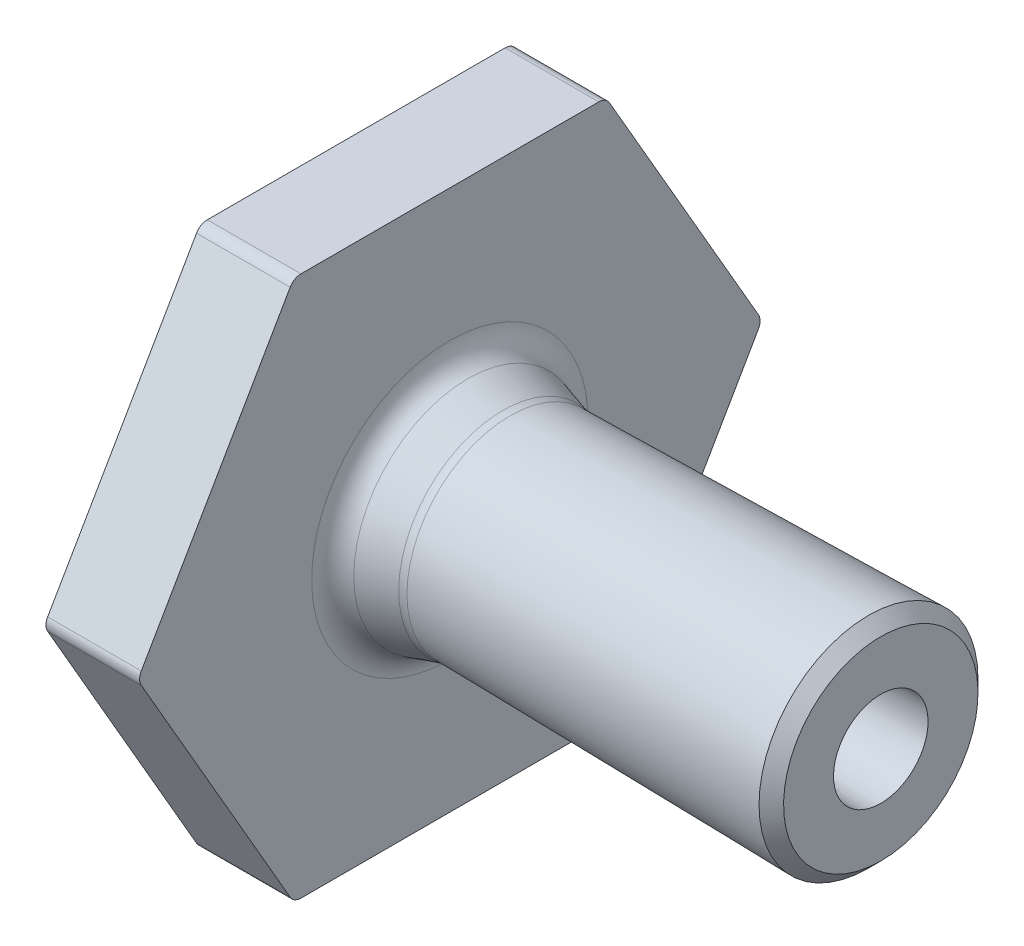
ISO-10303-21;
HEADER;
FILE_DESCRIPTION(('STEP AP214'),'2;1');
FILE_NAME('part.step','',(''),(''),'','','');
FILE_SCHEMA(('AUTOMOTIVE_DESIGN { 1 0 10303 214 1 1 1 1 }'));
ENDSEC;
DATA;
#1=APPLICATION_CONTEXT('core data for automotive mechanical design processes');
#2=APPLICATION_PROTOCOL_DEFINITION('international standard','automotive_design',2000,#1);
#3=PRODUCT_CONTEXT('',#1,'mechanical');
#4=PRODUCT('Part','Part','',(#3));
#5=PRODUCT_RELATED_PRODUCT_CATEGORY('part','',(#4));
#6=PRODUCT_DEFINITION_FORMATION('','',#4);
#7=PRODUCT_DEFINITION_CONTEXT('part definition',#1,'design');
#8=PRODUCT_DEFINITION('design','',#6,#7);
#9=PRODUCT_DEFINITION_SHAPE('','',#8);
#10=(LENGTH_UNIT() NAMED_UNIT(*) SI_UNIT(.MILLI.,.METRE.));
#11=(NAMED_UNIT(*) PLANE_ANGLE_UNIT() SI_UNIT($,.RADIAN.));
#12=(NAMED_UNIT(*) SI_UNIT($,.STERADIAN.) SOLID_ANGLE_UNIT());
#13=UNCERTAINTY_MEASURE_WITH_UNIT(LENGTH_MEASURE(1.E-05),#10,'distance_accuracy_value','');
#14=(GEOMETRIC_REPRESENTATION_CONTEXT(3) GLOBAL_UNCERTAINTY_ASSIGNED_CONTEXT((#13)) GLOBAL_UNIT_ASSIGNED_CONTEXT((#10,
#11,#12)) REPRESENTATION_CONTEXT('',''));
#15=CARTESIAN_POINT('',(0.,0.,0.));
#16=DIRECTION('',(0.,0.,1.));
#17=DIRECTION('',(1.,0.,0.));
#18=AXIS2_PLACEMENT_3D('',#15,#16,#17);
#19=CARTESIAN_POINT('',(6.99999999999996,3.82500000000001,0.));
#20=DIRECTION('',(-1.,0.,0.));
#21=DIRECTION('',(0.,-1.,0.));
#22=AXIS2_PLACEMENT_3D('',#19,#20,#21);
#23=PLANE('',#22);
#24=CARTESIAN_POINT('',(6.99999999999996,0.,0.));
#25=DIRECTION('',(-1.,0.,0.));
#26=DIRECTION('',(0.,-1.,0.));
#27=AXIS2_PLACEMENT_3D('',#24,#25,#26);
#28=CIRCLE('',#27,4.42784324008224);
#29=CARTESIAN_POINT('',(6.99999999999996,-4.42784324008224,0.));
#30=VERTEX_POINT('',#29);
#31=EDGE_CURVE('E285',#30,#30,#28,.T.);
#32=ORIENTED_EDGE('',*,*,#31,.T.);
#33=EDGE_LOOP('',(#32));
#34=FACE_BOUND('',#33,.T.);
#35=DIRECTION('',(0.,-0.866025403784439,-0.5));
#36=VECTOR('',#35,1.);
#37=CARTESIAN_POINT('',(6.99999999999996,7.1988770189222,-5.84372641526227));
#38=LINE('',#37,#36);
#39=CARTESIAN_POINT('',(6.99999999999996,8.4602540378444,-5.11547005383793));
#40=VERTEX_POINT('',#39);
#41=CARTESIAN_POINT('',(6.99999999999996,0.200000000000001,-9.88452994616208));
#42=VERTEX_POINT('',#41);
#43=EDGE_CURVE('E193',#40,#42,#38,.T.);
#44=ORIENTED_EDGE('',*,*,#43,.F.);
#45=CARTESIAN_POINT('',(6.99999999999996,8.2602540378444,-4.76905989232416));
#46=DIRECTION('',(-1.,0.,0.));
#47=DIRECTION('',(0.,-1.,0.));
#48=AXIS2_PLACEMENT_3D('',#45,#46,#47);
#49=CIRCLE('',#48,0.4);
#50=CARTESIAN_POINT('',(6.99999999999996,8.66025403784439,-4.76905989232416));
#51=VERTEX_POINT('',#50);
#52=EDGE_CURVE('E176',#40,#51,#49,.F.);
#53=ORIENTED_EDGE('',*,*,#52,.T.);
#54=DIRECTION('',(0.,0.,-1.));
#55=VECTOR('',#54,1.);
#56=CARTESIAN_POINT('',(6.99999999999996,8.66025403784439,0.));
#57=LINE('',#56,#55);
#58=CARTESIAN_POINT('',(6.99999999999996,8.66025403784439,4.76905989232416));
#59=VERTEX_POINT('',#58);
#60=EDGE_CURVE('E207',#59,#51,#57,.T.);
#61=ORIENTED_EDGE('',*,*,#60,.F.);
#62=CARTESIAN_POINT('',(6.99999999999996,8.2602540378444,4.76905989232416));
#63=DIRECTION('',(-1.,0.,0.));
#64=DIRECTION('',(0.,-1.,0.));
#65=AXIS2_PLACEMENT_3D('',#62,#63,#64);
#66=CIRCLE('',#65,0.4);
#67=CARTESIAN_POINT('',(6.99999999999996,8.4602540378444,5.11547005383793));
#68=VERTEX_POINT('',#67);
#69=EDGE_CURVE('E197',#59,#68,#66,.F.);
#70=ORIENTED_EDGE('',*,*,#69,.T.);
#71=DIRECTION('',(0.,0.866025403784439,-0.5));
#72=VECTOR('',#71,1.);
#73=CARTESIAN_POINT('',(6.99999999999996,7.1988770189222,5.84372641526227));
#74=LINE('',#73,#72);
#75=CARTESIAN_POINT('',(6.99999999999996,0.2,9.88452994616209));
#76=VERTEX_POINT('',#75);
#77=EDGE_CURVE('E201',#76,#68,#74,.T.);
#78=ORIENTED_EDGE('',*,*,#77,.F.);
#79=CARTESIAN_POINT('',(6.99999999999996,0.,9.53811978464831));
#80=DIRECTION('',(-1.,0.,0.));
#81=DIRECTION('',(0.,-1.,0.));
#82=AXIS2_PLACEMENT_3D('',#79,#80,#81);
#83=CIRCLE('',#82,0.4);
#84=CARTESIAN_POINT('',(6.99999999999996,-0.199999999999997,9.88452994616209));
#85=VERTEX_POINT('',#84);
#86=EDGE_CURVE('E245',#76,#85,#83,.F.);
#87=ORIENTED_EDGE('',*,*,#86,.T.);
#88=DIRECTION('',(0.,0.866025403784439,0.5));
#89=VECTOR('',#88,1.);
#90=CARTESIAN_POINT('',(6.99999999999996,-1.46137701892219,9.15627358473775));
#91=LINE('',#90,#89);
#92=CARTESIAN_POINT('',(6.99999999999996,-8.4602540378444,5.11547005383793));
#93=VERTEX_POINT('',#92);
#94=EDGE_CURVE('E586',#93,#85,#91,.T.);
#95=ORIENTED_EDGE('',*,*,#94,.F.);
#96=CARTESIAN_POINT('',(6.99999999999996,-8.2602540378444,4.76905989232415));
#97=DIRECTION('',(-1.,0.,0.));
#98=DIRECTION('',(0.,-1.,0.));
#99=AXIS2_PLACEMENT_3D('',#96,#97,#98);
#100=CIRCLE('',#99,0.4);
#101=CARTESIAN_POINT('',(6.99999999999996,-8.6602540378444,4.76905989232415));
#102=VERTEX_POINT('',#101);
#103=EDGE_CURVE('E247',#93,#102,#100,.F.);
#104=ORIENTED_EDGE('',*,*,#103,.T.);
#105=DIRECTION('',(0.,0.,1.));
#106=VECTOR('',#105,1.);
#107=CARTESIAN_POINT('',(6.99999999999996,-8.6602540378444,0.));
#108=LINE('',#107,#106);
#109=CARTESIAN_POINT('',(6.99999999999996,-8.6602540378444,-4.76905989232415));
#110=VERTEX_POINT('',#109);
#111=EDGE_CURVE('E202',#110,#102,#108,.T.);
#112=ORIENTED_EDGE('',*,*,#111,.F.);
#113=CARTESIAN_POINT('',(6.99999999999996,-8.2602540378444,-4.76905989232415));
#114=DIRECTION('',(-1.,0.,0.));
#115=DIRECTION('',(0.,-1.,0.));
#116=AXIS2_PLACEMENT_3D('',#113,#114,#115);
#117=CIRCLE('',#116,0.4);
#118=CARTESIAN_POINT('',(6.99999999999996,-8.4602540378444,-5.11547005383793));
#119=VERTEX_POINT('',#118);
#120=EDGE_CURVE('E249',#110,#119,#117,.F.);
#121=ORIENTED_EDGE('',*,*,#120,.T.);
#122=DIRECTION('',(0.,-0.866025403784439,0.5));
#123=VECTOR('',#122,1.);
#124=CARTESIAN_POINT('',(6.99999999999996,-1.46137701892219,-9.15627358473775));
#125=LINE('',#124,#123);
#126=CARTESIAN_POINT('',(6.99999999999996,-0.199999999999998,-9.88452994616208));
#127=VERTEX_POINT('',#126);
#128=EDGE_CURVE('E578',#127,#119,#125,.T.);
#129=ORIENTED_EDGE('',*,*,#128,.F.);
#130=CARTESIAN_POINT('',(6.99999999999996,0.,-9.53811978464831));
#131=DIRECTION('',(-1.,0.,0.));
#132=DIRECTION('',(0.,-1.,0.));
#133=AXIS2_PLACEMENT_3D('',#130,#131,#132);
#134=CIRCLE('',#133,0.4);
#135=EDGE_CURVE('E187',#127,#42,#134,.F.);
#136=ORIENTED_EDGE('',*,*,#135,.T.);
#137=EDGE_LOOP('',(#44,#53,#61,#70,#78,#87,#95,#104,#112,#121,#129,#136));
#138=FACE_BOUND('',#137,.T.);
#139=ADVANCED_FACE('F85',(#34,#138),#23,.F.);
#140=CARTESIAN_POINT('',(4.,10.,0.));
#141=DIRECTION('',(1.,0.,0.));
#142=DIRECTION('',(0.,1.,0.));
#143=AXIS2_PLACEMENT_3D('',#140,#141,#142);
#144=PLANE('',#143);
#145=CARTESIAN_POINT('',(4.,0.,0.));
#146=DIRECTION('',(1.,0.,0.));
#147=DIRECTION('',(0.,1.,0.));
#148=AXIS2_PLACEMENT_3D('',#145,#146,#147);
#149=CIRCLE('',#148,2.82500000000001);
#150=CARTESIAN_POINT('',(4.,2.82500000000001,0.));
#151=VERTEX_POINT('',#150);
#152=EDGE_CURVE('E12',#151,#151,#149,.T.);
#153=ORIENTED_EDGE('',*,*,#152,.T.);
#154=EDGE_LOOP('',(#153));
#155=FACE_BOUND('',#154,.T.);
#156=DIRECTION('',(0.,0.,1.));
#157=VECTOR('',#156,1.);
#158=CARTESIAN_POINT('',(4.,8.66025403784439,0.));
#159=LINE('',#158,#157);
#160=CARTESIAN_POINT('',(4.,8.66025403784439,-4.76905989232416));
#161=VERTEX_POINT('',#160);
#162=CARTESIAN_POINT('',(4.,8.66025403784439,4.76905989232416));
#163=VERTEX_POINT('',#162);
#164=EDGE_CURVE('E583',#161,#163,#159,.T.);
#165=ORIENTED_EDGE('',*,*,#164,.F.);
#166=CARTESIAN_POINT('',(4.,8.2602540378444,-4.76905989232416));
#167=DIRECTION('',(1.,0.,0.));
#168=DIRECTION('',(0.,1.,0.));
#169=AXIS2_PLACEMENT_3D('',#166,#167,#168);
#170=CIRCLE('',#169,0.4);
#171=CARTESIAN_POINT('',(4.,8.4602540378444,-5.11547005383793));
#172=VERTEX_POINT('',#171);
#173=EDGE_CURVE('E264',#161,#172,#170,.F.);
#174=ORIENTED_EDGE('',*,*,#173,.T.);
#175=DIRECTION('',(0.,0.866025403784439,0.5));
#176=VECTOR('',#175,1.);
#177=CARTESIAN_POINT('',(4.,11.8301270189222,-3.16987298107782));
#178=LINE('',#177,#176);
#179=CARTESIAN_POINT('',(4.,0.199999999999999,-9.88452994616208));
#180=VERTEX_POINT('',#179);
#181=EDGE_CURVE('E196',#180,#172,#178,.T.);
#182=ORIENTED_EDGE('',*,*,#181,.F.);
#183=CARTESIAN_POINT('',(4.,0.,-9.53811978464831));
#184=DIRECTION('',(1.,0.,0.));
#185=DIRECTION('',(0.,1.,0.));
#186=AXIS2_PLACEMENT_3D('',#183,#184,#185);
#187=CIRCLE('',#186,0.4);
#188=CARTESIAN_POINT('',(4.,-0.199999999999998,-9.88452994616208));
#189=VERTEX_POINT('',#188);
#190=EDGE_CURVE('E262',#180,#189,#187,.F.);
#191=ORIENTED_EDGE('',*,*,#190,.T.);
#192=DIRECTION('',(0.,0.866025403784439,-0.5));
#193=VECTOR('',#192,1.);
#194=CARTESIAN_POINT('',(4.,3.16987298107781,-11.8301270189222));
#195=LINE('',#194,#193);
#196=CARTESIAN_POINT('',(4.,-8.4602540378444,-5.11547005383792));
#197=VERTEX_POINT('',#196);
#198=EDGE_CURVE('E573',#197,#189,#195,.T.);
#199=ORIENTED_EDGE('',*,*,#198,.F.);
#200=CARTESIAN_POINT('',(4.,-8.2602540378444,-4.76905989232415));
#201=DIRECTION('',(1.,0.,0.));
#202=DIRECTION('',(0.,1.,0.));
#203=AXIS2_PLACEMENT_3D('',#200,#201,#202);
#204=CIRCLE('',#203,0.4);
#205=CARTESIAN_POINT('',(4.,-8.6602540378444,-4.76905989232415));
#206=VERTEX_POINT('',#205);
#207=EDGE_CURVE('E260',#197,#206,#204,.F.);
#208=ORIENTED_EDGE('',*,*,#207,.T.);
#209=DIRECTION('',(0.,0.,-1.));
#210=VECTOR('',#209,1.);
#211=CARTESIAN_POINT('',(4.,-8.6602540378444,0.));
#212=LINE('',#211,#210);
#213=CARTESIAN_POINT('',(4.,-8.6602540378444,4.76905989232415));
#214=VERTEX_POINT('',#213);
#215=EDGE_CURVE('E237',#214,#206,#212,.T.);
#216=ORIENTED_EDGE('',*,*,#215,.F.);
#217=CARTESIAN_POINT('',(4.,-8.2602540378444,4.76905989232415));
#218=DIRECTION('',(1.,0.,0.));
#219=DIRECTION('',(0.,1.,0.));
#220=AXIS2_PLACEMENT_3D('',#217,#218,#219);
#221=CIRCLE('',#220,0.4);
#222=CARTESIAN_POINT('',(4.,-8.4602540378444,5.11547005383793));
#223=VERTEX_POINT('',#222);
#224=EDGE_CURVE('E258',#214,#223,#221,.F.);
#225=ORIENTED_EDGE('',*,*,#224,.T.);
#226=DIRECTION('',(0.,-0.866025403784439,-0.5));
#227=VECTOR('',#226,1.);
#228=CARTESIAN_POINT('',(4.,3.16987298107781,11.8301270189222));
#229=LINE('',#228,#227);
#230=CARTESIAN_POINT('',(4.,-0.199999999999999,9.88452994616208));
#231=VERTEX_POINT('',#230);
#232=EDGE_CURVE('E589',#231,#223,#229,.T.);
#233=ORIENTED_EDGE('',*,*,#232,.F.);
#234=CARTESIAN_POINT('',(4.,0.,9.53811978464831));
#235=DIRECTION('',(1.,0.,0.));
#236=DIRECTION('',(0.,1.,0.));
#237=AXIS2_PLACEMENT_3D('',#234,#235,#236);
#238=CIRCLE('',#237,0.4);
#239=CARTESIAN_POINT('',(4.,0.199999999999997,9.88452994616209));
#240=VERTEX_POINT('',#239);
#241=EDGE_CURVE('E100',#231,#240,#238,.F.);
#242=ORIENTED_EDGE('',*,*,#241,.T.);
#243=DIRECTION('',(0.,-0.866025403784439,0.5));
#244=VECTOR('',#243,1.);
#245=CARTESIAN_POINT('',(4.,11.8301270189222,3.16987298107781));
#246=LINE('',#245,#244);
#247=CARTESIAN_POINT('',(4.,8.46025403784439,5.11547005383793));
#248=VERTEX_POINT('',#247);
#249=EDGE_CURVE('E241',#248,#240,#246,.T.);
#250=ORIENTED_EDGE('',*,*,#249,.F.);
#251=CARTESIAN_POINT('',(4.,8.2602540378444,4.76905989232416));
#252=DIRECTION('',(1.,0.,0.));
#253=DIRECTION('',(0.,1.,0.));
#254=AXIS2_PLACEMENT_3D('',#251,#252,#253);
#255=CIRCLE('',#254,0.4);
#256=EDGE_CURVE('E255',#248,#163,#255,.F.);
#257=ORIENTED_EDGE('',*,*,#256,.T.);
#258=EDGE_LOOP('',(#165,#174,#182,#191,#199,#208,#216,#225,#233,#242,#250,#257));
#259=FACE_BOUND('',#258,.T.);
#260=ADVANCED_FACE('F312',(#155,#259),#144,.F.);
#261=CARTESIAN_POINT('',(6.71891833059518,0.,0.));
#262=DIRECTION('',(-1.,0.,0.));
#263=DIRECTION('',(0.,-1.,0.));
#264=AXIS2_PLACEMENT_3D('',#261,#262,#263);
#265=CONICAL_SURFACE('',#264,1.82500000000001,0.279252680319093);
#266=CARTESIAN_POINT('',(8.11882634456201,0.,0.));
#267=DIRECTION('',(1.,0.,0.));
#268=DIRECTION('',(0.,1.,0.));
#269=AXIS2_PLACEMENT_3D('',#266,#267,#268);
#270=CIRCLE('',#269,1.42358283650824);
#271=CARTESIAN_POINT('',(8.11882634456201,1.42358283650824,0.));
#272=VERTEX_POINT('',#271);
#273=EDGE_CURVE('E225',#272,#272,#270,.T.);
#274=ORIENTED_EDGE('',*,*,#273,.T.);
#275=EDGE_LOOP('',(#274));
#276=FACE_BOUND('',#275,.T.);
#277=CARTESIAN_POINT('',(7.124207893939,0.,0.));
#278=DIRECTION('',(-1.,0.,0.));
#279=DIRECTION('',(0.,-1.,0.));
#280=AXIS2_PLACEMENT_3D('',#277,#278,#279);
#281=CIRCLE('',#280,1.70878508781496);
#282=CARTESIAN_POINT('',(7.124207893939,-1.70878508781496,0.));
#283=VERTEX_POINT('',#282);
#284=EDGE_CURVE('E222',#283,#283,#281,.T.);
#285=ORIENTED_EDGE('',*,*,#284,.T.);
#286=EDGE_LOOP('',(#285));
#287=FACE_BOUND('',#286,.T.);
#288=ADVANCED_FACE('F318',(#276,#287),#265,.F.);
#289=CARTESIAN_POINT('',(8.54981091361165,0.,0.));
#290=DIRECTION('',(1.,0.,0.));
#291=DIRECTION('',(0.,1.,0.));
#292=AXIS2_PLACEMENT_3D('',#289,#290,#291);
#293=CONICAL_SURFACE('',#292,1.30000000000001,0.0174532925199508);
#294=CARTESIAN_POINT('',(8.99809563132489,0.,0.));
#295=DIRECTION('',(-1.,0.,0.));
#296=DIRECTION('',(0.,-1.,0.));
#297=AXIS2_PLACEMENT_3D('',#294,#295,#296);
#298=CIRCLE('',#297,1.30782483885402);
#299=CARTESIAN_POINT('',(8.99809563132489,-1.30782483885402,0.));
#300=VERTEX_POINT('',#299);
#301=EDGE_CURVE('E219',#300,#300,#298,.T.);
#302=ORIENTED_EDGE('',*,*,#301,.T.);
#303=EDGE_LOOP('',(#302));
#304=FACE_BOUND('',#303,.T.);
#305=CARTESIAN_POINT('',(20.8041337064255,0.,0.));
#306=DIRECTION('',(-1.,0.,0.));
#307=DIRECTION('',(0.,-1.,0.));
#308=AXIS2_PLACEMENT_3D('',#305,#306,#307);
#309=CIRCLE('',#308,1.5139);
#310=CARTESIAN_POINT('',(20.8041337064255,-1.5139,0.));
#311=VERTEX_POINT('',#310);
#312=EDGE_CURVE('E216',#311,#311,#309,.T.);
#313=ORIENTED_EDGE('',*,*,#312,.F.);
#314=EDGE_LOOP('',(#313));
#315=FACE_BOUND('',#314,.T.);
#316=ADVANCED_FACE('F334',(#304,#315),#293,.F.);
#317=CARTESIAN_POINT('',(20.8041337064256,1.5139,0.));
#318=DIRECTION('',(-1.,0.,0.));
#319=DIRECTION('',(0.,-1.,0.));
#320=AXIS2_PLACEMENT_3D('',#317,#318,#319);
#321=PLANE('',#320);
#322=CARTESIAN_POINT('',(20.8041337064256,0.,0.));
#323=DIRECTION('',(-1.,0.,0.));
#324=DIRECTION('',(0.,-1.,0.));
#325=AXIS2_PLACEMENT_3D('',#322,#323,#324);
#326=CIRCLE('',#325,3.11420465608784);
#327=CARTESIAN_POINT('',(20.8041337064256,-3.11420465608784,0.));
#328=VERTEX_POINT('',#327);
#329=EDGE_CURVE('E234',#328,#328,#326,.F.);
#330=ORIENTED_EDGE('',*,*,#329,.T.);
#331=EDGE_LOOP('',(#330));
#332=FACE_BOUND('',#331,.T.);
#333=ORIENTED_EDGE('',*,*,#312,.T.);
#334=EDGE_LOOP('',(#333));
#335=FACE_BOUND('',#334,.T.);
#336=ADVANCED_FACE('F330',(#332,#335),#321,.F.);
#337=CARTESIAN_POINT('',(8.81376257921256,0.,0.));
#338=DIRECTION('',(1.,0.,0.));
#339=DIRECTION('',(0.,1.,0.));
#340=AXIS2_PLACEMENT_3D('',#337,#338,#339);
#341=CONICAL_SURFACE('',#340,3.3049119495488,0.0174532925199508);
#342=CARTESIAN_POINT('',(8.93330517060276,0.,0.));
#343=DIRECTION('',(1.,0.,0.));
#344=DIRECTION('',(0.,1.,0.));
#345=AXIS2_PLACEMENT_3D('',#342,#343,#344);
#346=CIRCLE('',#345,3.3069985732432);
#347=CARTESIAN_POINT('',(8.93330517060276,3.3069985732432,0.));
#348=VERTEX_POINT('',#347);
#349=EDGE_CURVE('E294',#348,#348,#346,.T.);
#350=ORIENTED_EDGE('',*,*,#349,.T.);
#351=EDGE_LOOP('',(#350));
#352=FACE_BOUND('',#351,.T.);
#353=CARTESIAN_POINT('',(20.4109959514642,0.,0.));
#354=DIRECTION('',(1.,0.,0.));
#355=DIRECTION('',(0.,1.,0.));
#356=AXIS2_PLACEMENT_3D('',#353,#354,#355);
#357=CIRCLE('',#356,3.50734241104923);
#358=CARTESIAN_POINT('',(20.4109959514642,3.50734241104923,0.));
#359=VERTEX_POINT('',#358);
#360=EDGE_CURVE('E231',#359,#359,#357,.F.);
#361=ORIENTED_EDGE('',*,*,#360,.T.);
#362=EDGE_LOOP('',(#361));
#363=FACE_BOUND('',#362,.T.);
#364=ADVANCED_FACE('F326',(#352,#363),#341,.T.);
#365=CARTESIAN_POINT('',(6.99999999999997,0.,0.));
#366=DIRECTION('',(-1.,0.,0.));
#367=DIRECTION('',(0.,-1.,0.));
#368=AXIS2_PLACEMENT_3D('',#365,#366,#367);
#369=CONICAL_SURFACE('',#368,3.82500000000001,0.279252680319094);
#370=CARTESIAN_POINT('',(7.57949011534636,0.,0.));
#371=DIRECTION('',(1.,0.,0.));
#372=DIRECTION('',(0.,1.,0.));
#373=AXIS2_PLACEMENT_3D('',#370,#371,#372);
#374=CIRCLE('',#373,3.65883388333159);
#375=CARTESIAN_POINT('',(7.57949011534636,3.65883388333159,0.));
#376=VERTEX_POINT('',#375);
#377=EDGE_CURVE('E291',#376,#376,#374,.T.);
#378=ORIENTED_EDGE('',*,*,#377,.T.);
#379=EDGE_LOOP('',(#378));
#380=FACE_BOUND('',#379,.T.);
#381=CARTESIAN_POINT('',(8.69883336079932,0.,0.));
#382=DIRECTION('',(-1.,0.,0.));
#383=DIRECTION('',(0.,-1.,0.));
#384=AXIS2_PLACEMENT_3D('',#381,#382,#383);
#385=CIRCLE('',#384,3.33786737261766);
#386=CARTESIAN_POINT('',(8.69883336079932,-3.33786737261766,0.));
#387=VERTEX_POINT('',#386);
#388=EDGE_CURVE('E288',#387,#387,#385,.T.);
#389=ORIENTED_EDGE('',*,*,#388,.T.);
#390=EDGE_LOOP('',(#389));
#391=FACE_BOUND('',#390,.T.);
#392=ADVANCED_FACE('F323',(#380,#391),#369,.T.);
#393=CARTESIAN_POINT('',(0.,0.,0.));
#394=DIRECTION('',(-1.,0.,0.));
#395=DIRECTION('',(0.,-1.,0.));
#396=AXIS2_PLACEMENT_3D('',#393,#394,#395);
#397=CYLINDRICAL_SURFACE('',#396,2.62500000000001);
#398=CARTESIAN_POINT('',(3.8,0.,0.));
#399=DIRECTION('',(1.,0.,0.));
#400=DIRECTION('',(0.,1.,0.));
#401=AXIS2_PLACEMENT_3D('',#398,#399,#400);
#402=CIRCLE('',#401,2.62500000000001);
#403=CARTESIAN_POINT('',(3.8,2.62500000000001,0.));
#404=VERTEX_POINT('',#403);
#405=EDGE_CURVE('E93',#404,#404,#402,.F.);
#406=ORIENTED_EDGE('',*,*,#405,.T.);
#407=EDGE_LOOP('',(#406));
#408=FACE_BOUND('',#407,.T.);
#409=CARTESIAN_POINT('',(0.,0.,0.));
#410=DIRECTION('',(-1.,0.,0.));
#411=DIRECTION('',(0.,-1.,0.));
#412=AXIS2_PLACEMENT_3D('',#409,#410,#411);
#413=CIRCLE('',#412,2.62500000000001);
#414=CARTESIAN_POINT('',(0.,-2.62500000000001,0.));
#415=VERTEX_POINT('',#414);
#416=EDGE_CURVE('E213',#415,#415,#413,.T.);
#417=ORIENTED_EDGE('',*,*,#416,.F.);
#418=EDGE_LOOP('',(#417));
#419=FACE_BOUND('',#418,.T.);
#420=ADVANCED_FACE('F299',(#408,#419),#397,.T.);
#421=CARTESIAN_POINT('',(0.,1.82500000000001,0.));
#422=DIRECTION('',(-1.,0.,0.));
#423=DIRECTION('',(0.,-1.,0.));
#424=AXIS2_PLACEMENT_3D('',#421,#422,#423);
#425=PLANE('',#424);
#426=ORIENTED_EDGE('',*,*,#416,.T.);
#427=EDGE_LOOP('',(#426));
#428=FACE_BOUND('',#427,.T.);
#429=CARTESIAN_POINT('',(0.,0.,0.));
#430=DIRECTION('',(-1.,0.,0.));
#431=DIRECTION('',(0.,-1.,0.));
#432=AXIS2_PLACEMENT_3D('',#429,#430,#431);
#433=CIRCLE('',#432,1.82500000000001);
#434=CARTESIAN_POINT('',(0.,-1.82500000000001,0.));
#435=VERTEX_POINT('',#434);
#436=EDGE_CURVE('E204',#435,#435,#433,.T.);
#437=ORIENTED_EDGE('',*,*,#436,.F.);
#438=EDGE_LOOP('',(#437));
#439=FACE_BOUND('',#438,.T.);
#440=ADVANCED_FACE('F416',(#428,#439),#425,.T.);
#441=CARTESIAN_POINT('',(0.,0.,0.));
#442=DIRECTION('',(-1.,0.,0.));
#443=DIRECTION('',(0.,-1.,0.));
#444=AXIS2_PLACEMENT_3D('',#441,#442,#443);
#445=CYLINDRICAL_SURFACE('',#444,1.82500000000001);
#446=CARTESIAN_POINT('',(6.297295826488,0.,0.));
#447=DIRECTION('',(-1.,0.,0.));
#448=DIRECTION('',(0.,-1.,0.));
#449=AXIS2_PLACEMENT_3D('',#446,#447,#448);
#450=CIRCLE('',#449,1.82500000000001);
#451=CARTESIAN_POINT('',(6.297295826488,-1.82500000000001,0.));
#452=VERTEX_POINT('',#451);
#453=EDGE_CURVE('E228',#452,#452,#450,.F.);
#454=ORIENTED_EDGE('',*,*,#453,.T.);
#455=EDGE_LOOP('',(#454));
#456=FACE_BOUND('',#455,.T.);
#457=ORIENTED_EDGE('',*,*,#436,.T.);
#458=EDGE_LOOP('',(#457));
#459=FACE_BOUND('',#458,.T.);
#460=ADVANCED_FACE('F346',(#456,#459),#445,.F.);
#461=CARTESIAN_POINT('',(8.94573841201301,0.,0.));
#462=DIRECTION('',(1.,0.,0.));
#463=DIRECTION('',(0.,1.,0.));
#464=AXIS2_PLACEMENT_3D('',#461,#462,#463);
#465=TOROIDAL_SURFACE('',#464,4.3073679243232,3.);
#466=ORIENTED_EDGE('',*,*,#273,.F.);
#467=EDGE_LOOP('',(#466));
#468=FACE_BOUND('',#467,.T.);
#469=ORIENTED_EDGE('',*,*,#301,.F.);
#470=EDGE_LOOP('',(#469));
#471=FACE_BOUND('',#470,.T.);
#472=ADVANCED_FACE('F342',(#468,#471),#465,.T.);
#473=CARTESIAN_POINT('',(6.297295826488,0.,0.));
#474=DIRECTION('',(-1.,0.,0.));
#475=DIRECTION('',(0.,-1.,0.));
#476=AXIS2_PLACEMENT_3D('',#473,#474,#475);
#477=DEGENERATE_TOROIDAL_SURFACE('',#476,1.17499999999999,3.,.F.);
#478=ORIENTED_EDGE('',*,*,#453,.F.);
#479=EDGE_LOOP('',(#478));
#480=FACE_BOUND('',#479,.T.);
#481=ORIENTED_EDGE('',*,*,#284,.F.);
#482=EDGE_LOOP('',(#481));
#483=FACE_BOUND('',#482,.T.);
#484=ADVANCED_FACE('F345',(#480,#483),#477,.T.);
#485=CARTESIAN_POINT('',(20.4109959514642,0.,0.));
#486=DIRECTION('',(-1.,0.,0.));
#487=DIRECTION('',(0.,-1.,0.));
#488=AXIS2_PLACEMENT_3D('',#485,#486,#487);
#489=CONICAL_SURFACE('',#488,3.50734241104923,0.785398163397442);
#490=ORIENTED_EDGE('',*,*,#329,.F.);
#491=EDGE_LOOP('',(#490));
#492=FACE_BOUND('',#491,.T.);
#493=ORIENTED_EDGE('',*,*,#360,.F.);
#494=EDGE_LOOP('',(#493));
#495=FACE_BOUND('',#494,.T.);
#496=ADVANCED_FACE('F350',(#492,#495),#489,.T.);
#497=CARTESIAN_POINT('',(0.,-8.66025403784439,0.));
#498=DIRECTION('',(0.,-1.,0.));
#499=DIRECTION('',(0.,0.,-1.));
#500=AXIS2_PLACEMENT_3D('',#497,#498,#499);
#501=PLANE('',#500);
#502=ORIENTED_EDGE('',*,*,#215,.T.);
#503=DIRECTION('',(1.,0.,0.));
#504=VECTOR('',#503,1.);
#505=CARTESIAN_POINT('',(0.,-8.66025403784439,-4.76905989232415));
#506=LINE('',#505,#504);
#507=EDGE_CURVE('E273',#206,#110,#506,.T.);
#508=ORIENTED_EDGE('',*,*,#507,.T.);
#509=ORIENTED_EDGE('',*,*,#111,.T.);
#510=DIRECTION('',(1.,0.,0.));
#511=VECTOR('',#510,1.);
#512=CARTESIAN_POINT('',(0.,-8.66025403784439,4.76905989232415));
#513=LINE('',#512,#511);
#514=EDGE_CURVE('E271',#102,#214,#513,.F.);
#515=ORIENTED_EDGE('',*,*,#514,.T.);
#516=EDGE_LOOP('',(#502,#508,#509,#515));
#517=FACE_BOUND('',#516,.T.);
#518=ADVANCED_FACE('F357',(#517),#501,.T.);
#519=CARTESIAN_POINT('',(0.,4.3301270189222,-7.50000000000001));
#520=DIRECTION('',(0.,0.5,-0.866025403784439));
#521=DIRECTION('',(0.,0.866025403784439,0.5));
#522=AXIS2_PLACEMENT_3D('',#519,#520,#521);
#523=PLANE('',#522);
#524=ORIENTED_EDGE('',*,*,#181,.T.);
#525=DIRECTION('',(1.,0.,0.));
#526=VECTOR('',#525,1.);
#527=CARTESIAN_POINT('',(0.,8.4602540378444,-5.11547005383793));
#528=LINE('',#527,#526);
#529=EDGE_CURVE('E180',#172,#40,#528,.T.);
#530=ORIENTED_EDGE('',*,*,#529,.T.);
#531=ORIENTED_EDGE('',*,*,#43,.T.);
#532=DIRECTION('',(1.,0.,0.));
#533=VECTOR('',#532,1.);
#534=CARTESIAN_POINT('',(0.,0.200000000000001,-9.88452994616208));
#535=LINE('',#534,#533);
#536=EDGE_CURVE('E198',#42,#180,#535,.F.);
#537=ORIENTED_EDGE('',*,*,#536,.T.);
#538=EDGE_LOOP('',(#524,#530,#531,#537));
#539=FACE_BOUND('',#538,.T.);
#540=ADVANCED_FACE('F192',(#539),#523,.T.);
#541=CARTESIAN_POINT('',(0.,4.3301270189222,7.50000000000001));
#542=DIRECTION('',(0.,0.5,0.866025403784439));
#543=DIRECTION('',(0.,-0.866025403784439,0.5));
#544=AXIS2_PLACEMENT_3D('',#541,#542,#543);
#545=PLANE('',#544);
#546=ORIENTED_EDGE('',*,*,#249,.T.);
#547=DIRECTION('',(1.,0.,0.));
#548=VECTOR('',#547,1.);
#549=CARTESIAN_POINT('',(0.,0.200000000000002,9.88452994616209));
#550=LINE('',#549,#548);
#551=EDGE_CURVE('E282',#240,#76,#550,.T.);
#552=ORIENTED_EDGE('',*,*,#551,.T.);
#553=ORIENTED_EDGE('',*,*,#77,.T.);
#554=DIRECTION('',(1.,0.,0.));
#555=VECTOR('',#554,1.);
#556=CARTESIAN_POINT('',(0.,8.4602540378444,5.11547005383793));
#557=LINE('',#556,#555);
#558=EDGE_CURVE('E107',#68,#248,#557,.F.);
#559=ORIENTED_EDGE('',*,*,#558,.T.);
#560=EDGE_LOOP('',(#546,#552,#553,#559));
#561=FACE_BOUND('',#560,.T.);
#562=ADVANCED_FACE('F464',(#561),#545,.T.);
#563=CARTESIAN_POINT('',(0.,8.66025403784439,0.));
#564=DIRECTION('',(0.,1.,0.));
#565=DIRECTION('',(-1.,0.,0.));
#566=AXIS2_PLACEMENT_3D('',#563,#564,#565);
#567=PLANE('',#566);
#568=ORIENTED_EDGE('',*,*,#60,.T.);
#569=DIRECTION('',(1.,0.,0.));
#570=VECTOR('',#569,1.);
#571=CARTESIAN_POINT('',(0.,8.66025403784439,-4.76905989232416));
#572=LINE('',#571,#570);
#573=EDGE_CURVE('E181',#51,#161,#572,.F.);
#574=ORIENTED_EDGE('',*,*,#573,.T.);
#575=ORIENTED_EDGE('',*,*,#164,.T.);
#576=DIRECTION('',(1.,0.,0.));
#577=VECTOR('',#576,1.);
#578=CARTESIAN_POINT('',(0.,8.66025403784439,4.76905989232416));
#579=LINE('',#578,#577);
#580=EDGE_CURVE('E186',#163,#59,#579,.T.);
#581=ORIENTED_EDGE('',*,*,#580,.T.);
#582=EDGE_LOOP('',(#568,#574,#575,#581));
#583=FACE_BOUND('',#582,.T.);
#584=ADVANCED_FACE('F471',(#583),#567,.T.);
#585=CARTESIAN_POINT('',(0.,-4.3301270189222,7.50000000000001));
#586=DIRECTION('',(0.,-0.5,0.866025403784439));
#587=DIRECTION('',(0.,-0.866025403784439,-0.5));
#588=AXIS2_PLACEMENT_3D('',#585,#586,#587);
#589=PLANE('',#588);
#590=ORIENTED_EDGE('',*,*,#232,.T.);
#591=DIRECTION('',(1.,0.,0.));
#592=VECTOR('',#591,1.);
#593=CARTESIAN_POINT('',(0.,-8.4602540378444,5.11547005383793));
#594=LINE('',#593,#592);
#595=EDGE_CURVE('E278',#223,#93,#594,.T.);
#596=ORIENTED_EDGE('',*,*,#595,.T.);
#597=ORIENTED_EDGE('',*,*,#94,.T.);
#598=DIRECTION('',(1.,0.,0.));
#599=VECTOR('',#598,1.);
#600=CARTESIAN_POINT('',(0.,-0.199999999999997,9.88452994616209));
#601=LINE('',#600,#599);
#602=EDGE_CURVE('E276',#85,#231,#601,.F.);
#603=ORIENTED_EDGE('',*,*,#602,.T.);
#604=EDGE_LOOP('',(#590,#596,#597,#603));
#605=FACE_BOUND('',#604,.T.);
#606=ADVANCED_FACE('F478',(#605),#589,.T.);
#607=CARTESIAN_POINT('',(0.,-4.33012701892219,-7.50000000000001));
#608=DIRECTION('',(0.,-0.5,-0.866025403784439));
#609=DIRECTION('',(0.,0.866025403784439,-0.5));
#610=AXIS2_PLACEMENT_3D('',#607,#608,#609);
#611=PLANE('',#610);
#612=ORIENTED_EDGE('',*,*,#198,.T.);
#613=DIRECTION('',(1.,0.,0.));
#614=VECTOR('',#613,1.);
#615=CARTESIAN_POINT('',(0.,-0.199999999999999,-9.88452994616208));
#616=LINE('',#615,#614);
#617=EDGE_CURVE('E268',#189,#127,#616,.T.);
#618=ORIENTED_EDGE('',*,*,#617,.T.);
#619=ORIENTED_EDGE('',*,*,#128,.T.);
#620=DIRECTION('',(1.,0.,0.));
#621=VECTOR('',#620,1.);
#622=CARTESIAN_POINT('',(0.,-8.4602540378444,-5.11547005383793));
#623=LINE('',#622,#621);
#624=EDGE_CURVE('E266',#119,#197,#623,.F.);
#625=ORIENTED_EDGE('',*,*,#624,.T.);
#626=EDGE_LOOP('',(#612,#618,#619,#625));
#627=FACE_BOUND('',#626,.T.);
#628=ADVANCED_FACE('F362',(#627),#611,.T.);
#629=CARTESIAN_POINT('',(0.,8.2602540378444,-4.76905989232416));
#630=DIRECTION('',(1.,0.,0.));
#631=DIRECTION('',(0.,1.,0.));
#632=AXIS2_PLACEMENT_3D('',#629,#630,#631);
#633=CYLINDRICAL_SURFACE('',#632,0.4);
#634=ORIENTED_EDGE('',*,*,#173,.F.);
#635=ORIENTED_EDGE('',*,*,#573,.F.);
#636=ORIENTED_EDGE('',*,*,#52,.F.);
#637=ORIENTED_EDGE('',*,*,#529,.F.);
#638=EDGE_LOOP('',(#634,#635,#636,#637));
#639=FACE_BOUND('',#638,.T.);
#640=ADVANCED_FACE('F179',(#639),#633,.T.);
#641=CARTESIAN_POINT('',(0.,0.,-9.53811978464831));
#642=DIRECTION('',(1.,0.,0.));
#643=DIRECTION('',(0.,1.,0.));
#644=AXIS2_PLACEMENT_3D('',#641,#642,#643);
#645=CYLINDRICAL_SURFACE('',#644,0.4);
#646=ORIENTED_EDGE('',*,*,#190,.F.);
#647=ORIENTED_EDGE('',*,*,#536,.F.);
#648=ORIENTED_EDGE('',*,*,#135,.F.);
#649=ORIENTED_EDGE('',*,*,#617,.F.);
#650=EDGE_LOOP('',(#646,#647,#648,#649));
#651=FACE_BOUND('',#650,.T.);
#652=ADVANCED_FACE('F361',(#651),#645,.T.);
#653=CARTESIAN_POINT('',(0.,-8.2602540378444,-4.76905989232415));
#654=DIRECTION('',(1.,0.,0.));
#655=DIRECTION('',(0.,1.,0.));
#656=AXIS2_PLACEMENT_3D('',#653,#654,#655);
#657=CYLINDRICAL_SURFACE('',#656,0.4);
#658=ORIENTED_EDGE('',*,*,#207,.F.);
#659=ORIENTED_EDGE('',*,*,#624,.F.);
#660=ORIENTED_EDGE('',*,*,#120,.F.);
#661=ORIENTED_EDGE('',*,*,#507,.F.);
#662=EDGE_LOOP('',(#658,#659,#660,#661));
#663=FACE_BOUND('',#662,.T.);
#664=ADVANCED_FACE('F365',(#663),#657,.T.);
#665=CARTESIAN_POINT('',(0.,-8.2602540378444,4.76905989232415));
#666=DIRECTION('',(1.,0.,0.));
#667=DIRECTION('',(0.,1.,0.));
#668=AXIS2_PLACEMENT_3D('',#665,#666,#667);
#669=CYLINDRICAL_SURFACE('',#668,0.4);
#670=ORIENTED_EDGE('',*,*,#224,.F.);
#671=ORIENTED_EDGE('',*,*,#514,.F.);
#672=ORIENTED_EDGE('',*,*,#103,.F.);
#673=ORIENTED_EDGE('',*,*,#595,.F.);
#674=EDGE_LOOP('',(#670,#671,#672,#673));
#675=FACE_BOUND('',#674,.T.);
#676=ADVANCED_FACE('F369',(#675),#669,.T.);
#677=CARTESIAN_POINT('',(0.,0.,9.53811978464831));
#678=DIRECTION('',(1.,0.,0.));
#679=DIRECTION('',(0.,1.,0.));
#680=AXIS2_PLACEMENT_3D('',#677,#678,#679);
#681=CYLINDRICAL_SURFACE('',#680,0.4);
#682=ORIENTED_EDGE('',*,*,#241,.F.);
#683=ORIENTED_EDGE('',*,*,#602,.F.);
#684=ORIENTED_EDGE('',*,*,#86,.F.);
#685=ORIENTED_EDGE('',*,*,#551,.F.);
#686=EDGE_LOOP('',(#682,#683,#684,#685));
#687=FACE_BOUND('',#686,.T.);
#688=ADVANCED_FACE('F373',(#687),#681,.T.);
#689=CARTESIAN_POINT('',(0.,8.2602540378444,4.76905989232416));
#690=DIRECTION('',(1.,0.,0.));
#691=DIRECTION('',(0.,1.,0.));
#692=AXIS2_PLACEMENT_3D('',#689,#690,#691);
#693=CYLINDRICAL_SURFACE('',#692,0.4);
#694=ORIENTED_EDGE('',*,*,#256,.F.);
#695=ORIENTED_EDGE('',*,*,#558,.F.);
#696=ORIENTED_EDGE('',*,*,#69,.F.);
#697=ORIENTED_EDGE('',*,*,#580,.F.);
#698=EDGE_LOOP('',(#694,#695,#696,#697));
#699=FACE_BOUND('',#698,.T.);
#700=ADVANCED_FACE('F377',(#699),#693,.T.);
#701=CARTESIAN_POINT('',(7.79999999999997,0.,0.));
#702=DIRECTION('',(-1.,0.,0.));
#703=DIRECTION('',(0.,-1.,0.));
#704=AXIS2_PLACEMENT_3D('',#701,#702,#703);
#705=TOROIDAL_SURFACE('',#704,4.42784324008224,0.8);
#706=ORIENTED_EDGE('',*,*,#377,.F.);
#707=EDGE_LOOP('',(#706));
#708=FACE_BOUND('',#707,.T.);
#709=ORIENTED_EDGE('',*,*,#31,.F.);
#710=EDGE_LOOP('',(#709));
#711=FACE_BOUND('',#710,.T.);
#712=ADVANCED_FACE('F308',(#708,#711),#705,.F.);
#713=CARTESIAN_POINT('',(8.91934324545292,0.,0.));
#714=DIRECTION('',(-1.,0.,0.));
#715=DIRECTION('',(0.,-1.,0.));
#716=AXIS2_PLACEMENT_3D('',#713,#714,#715);
#717=TOROIDAL_SURFACE('',#716,4.10687672936832,0.8);
#718=ORIENTED_EDGE('',*,*,#349,.F.);
#719=EDGE_LOOP('',(#718));
#720=FACE_BOUND('',#719,.T.);
#721=ORIENTED_EDGE('',*,*,#388,.F.);
#722=EDGE_LOOP('',(#721));
#723=FACE_BOUND('',#722,.T.);
#724=ADVANCED_FACE('F303',(#720,#723),#717,.F.);
#725=CARTESIAN_POINT('',(3.8,0.,0.));
#726=DIRECTION('',(1.,0.,0.));
#727=DIRECTION('',(0.,1.,0.));
#728=AXIS2_PLACEMENT_3D('',#725,#726,#727);
#729=TOROIDAL_SURFACE('',#728,2.82500000000001,0.2);
#730=ORIENTED_EDGE('',*,*,#152,.F.);
#731=EDGE_LOOP('',(#730));
#732=FACE_BOUND('',#731,.T.);
#733=ORIENTED_EDGE('',*,*,#405,.F.);
#734=EDGE_LOOP('',(#733));
#735=FACE_BOUND('',#734,.T.);
#736=ADVANCED_FACE('F87',(#732,#735),#729,.F.);
#737=CLOSED_SHELL('',(#139,#260,#288,#316,#336,#364,#392,#420,#440,#460,#472,#484,#496,#518,
#540,#562,#584,#606,#628,#640,#652,#664,#676,#688,#700,#712,#724,#736));
#738=MANIFOLD_SOLID_BREP('B2',#737);
#739=ADVANCED_BREP_SHAPE_REPRESENTATION('',(#18,#738),#14);
#740=SHAPE_DEFINITION_REPRESENTATION(#9,#739);
ENDSEC;
END-ISO-10303-21;
